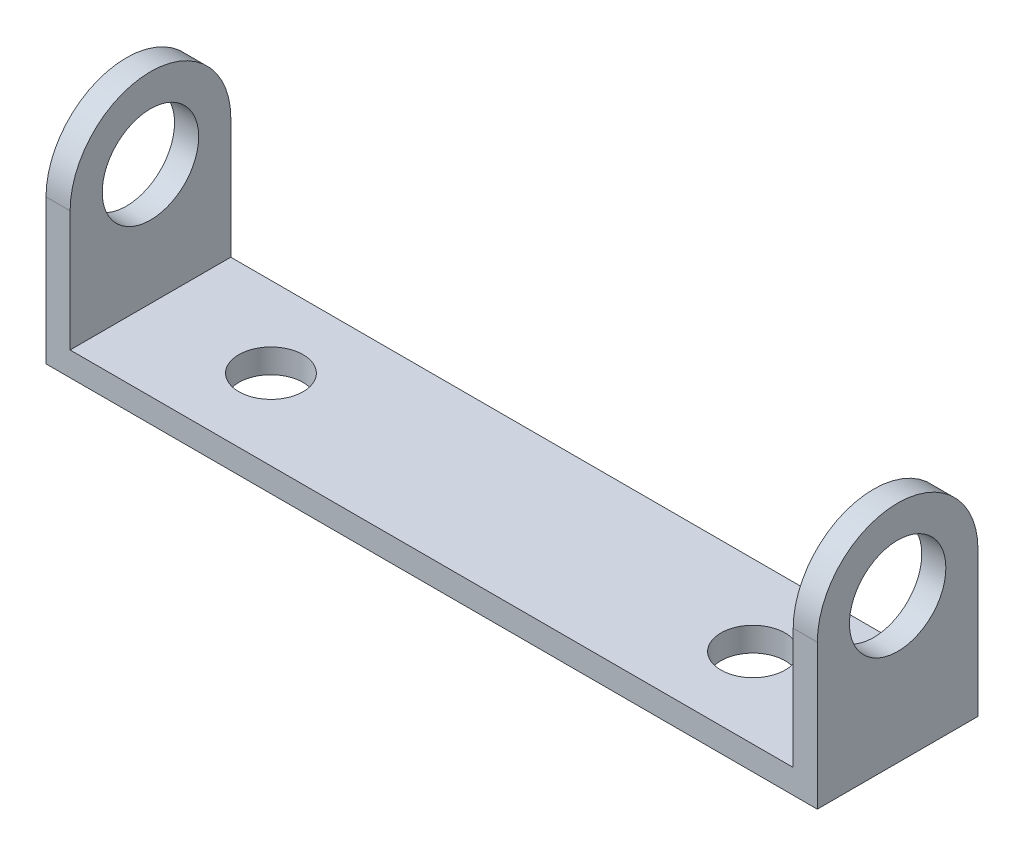
ISO-10303-21;
HEADER;
FILE_DESCRIPTION(('STEP AP214'),'2;1');
FILE_NAME('part.step','',(''),(''),'','','');
FILE_SCHEMA(('AUTOMOTIVE_DESIGN { 1 0 10303 214 1 1 1 1 }'));
ENDSEC;
DATA;
#1=APPLICATION_CONTEXT('core data for automotive mechanical design processes');
#2=APPLICATION_PROTOCOL_DEFINITION('international standard','automotive_design',2000,#1);
#3=PRODUCT_CONTEXT('',#1,'mechanical');
#4=PRODUCT('Part','Part','',(#3));
#5=PRODUCT_RELATED_PRODUCT_CATEGORY('part','',(#4));
#6=PRODUCT_DEFINITION_FORMATION('','',#4);
#7=PRODUCT_DEFINITION_CONTEXT('part definition',#1,'design');
#8=PRODUCT_DEFINITION('design','',#6,#7);
#9=PRODUCT_DEFINITION_SHAPE('','',#8);
#10=(LENGTH_UNIT() NAMED_UNIT(*) SI_UNIT(.MILLI.,.METRE.));
#11=(NAMED_UNIT(*) PLANE_ANGLE_UNIT() SI_UNIT($,.RADIAN.));
#12=(NAMED_UNIT(*) SI_UNIT($,.STERADIAN.) SOLID_ANGLE_UNIT());
#13=UNCERTAINTY_MEASURE_WITH_UNIT(LENGTH_MEASURE(1.E-05),#10,'distance_accuracy_value','');
#14=(GEOMETRIC_REPRESENTATION_CONTEXT(3) GLOBAL_UNCERTAINTY_ASSIGNED_CONTEXT((#13)) GLOBAL_UNIT_ASSIGNED_CONTEXT((#10,
#11,#12)) REPRESENTATION_CONTEXT('',''));
#15=CARTESIAN_POINT('',(0.,0.,0.));
#16=DIRECTION('',(0.,0.,1.));
#17=DIRECTION('',(1.,0.,0.));
#18=AXIS2_PLACEMENT_3D('',#15,#16,#17);
#19=CARTESIAN_POINT('',(-24.,-7.,10.));
#20=DIRECTION('',(1.,0.,0.));
#21=DIRECTION('',(0.,0.,-1.));
#22=AXIS2_PLACEMENT_3D('',#19,#20,#21);
#23=PLANE('',#22);
#24=CARTESIAN_POINT('',(-24.,2.,5.));
#25=DIRECTION('',(1.,0.,0.));
#26=DIRECTION('',(0.,0.,-1.));
#27=AXIS2_PLACEMENT_3D('',#24,#25,#26);
#28=CIRCLE('',#27,3.);
#29=CARTESIAN_POINT('',(-24.,2.,2.));
#30=VERTEX_POINT('',#29);
#31=EDGE_CURVE('E212',#30,#30,#28,.F.);
#32=ORIENTED_EDGE('',*,*,#31,.F.);
#33=EDGE_LOOP('',(#32));
#34=FACE_BOUND('',#33,.T.);
#35=CARTESIAN_POINT('',(-24.,2.,5.));
#36=DIRECTION('',(1.,0.,0.));
#37=DIRECTION('',(0.,0.,-1.));
#38=AXIS2_PLACEMENT_3D('',#35,#36,#37);
#39=CIRCLE('',#38,5.);
#40=CARTESIAN_POINT('',(-24.,2.,10.));
#41=VERTEX_POINT('',#40);
#42=CARTESIAN_POINT('',(-24.,2.,0.));
#43=VERTEX_POINT('',#42);
#44=EDGE_CURVE('E97',#41,#43,#39,.F.);
#45=ORIENTED_EDGE('',*,*,#44,.T.);
#46=DIRECTION('',(0.,-1.,0.));
#47=VECTOR('',#46,1.);
#48=CARTESIAN_POINT('',(-24.,-7.,0.));
#49=LINE('',#48,#47);
#50=CARTESIAN_POINT('',(-24.,-7.,0.));
#51=VERTEX_POINT('',#50);
#52=EDGE_CURVE('E163',#43,#51,#49,.T.);
#53=ORIENTED_EDGE('',*,*,#52,.T.);
#54=DIRECTION('',(0.,0.,-1.));
#55=VECTOR('',#54,1.);
#56=CARTESIAN_POINT('',(-24.,-7.,10.));
#57=LINE('',#56,#55);
#58=CARTESIAN_POINT('',(-24.,-7.,10.));
#59=VERTEX_POINT('',#58);
#60=EDGE_CURVE('E180',#59,#51,#57,.T.);
#61=ORIENTED_EDGE('',*,*,#60,.F.);
#62=DIRECTION('',(0.,-1.,0.));
#63=VECTOR('',#62,1.);
#64=CARTESIAN_POINT('',(-24.,-7.,10.));
#65=LINE('',#64,#63);
#66=EDGE_CURVE('E171',#41,#59,#65,.T.);
#67=ORIENTED_EDGE('',*,*,#66,.F.);
#68=EDGE_LOOP('',(#45,#53,#61,#67));
#69=FACE_BOUND('',#68,.T.);
#70=ADVANCED_FACE('F74',(#34,#69),#23,.F.);
#71=CARTESIAN_POINT('',(24.,-7.,10.));
#72=DIRECTION('',(-1.,0.,0.));
#73=DIRECTION('',(0.,0.,1.));
#74=AXIS2_PLACEMENT_3D('',#71,#72,#73);
#75=PLANE('',#74);
#76=CARTESIAN_POINT('',(24.,2.,5.));
#77=DIRECTION('',(1.,0.,0.));
#78=DIRECTION('',(0.,0.,-1.));
#79=AXIS2_PLACEMENT_3D('',#76,#77,#78);
#80=CIRCLE('',#79,3.);
#81=CARTESIAN_POINT('',(24.,2.,2.));
#82=VERTEX_POINT('',#81);
#83=EDGE_CURVE('E215',#82,#82,#80,.T.);
#84=ORIENTED_EDGE('',*,*,#83,.F.);
#85=EDGE_LOOP('',(#84));
#86=FACE_BOUND('',#85,.T.);
#87=DIRECTION('',(0.,1.,0.));
#88=VECTOR('',#87,1.);
#89=CARTESIAN_POINT('',(24.,-7.,0.));
#90=LINE('',#89,#88);
#91=CARTESIAN_POINT('',(24.,-7.,0.));
#92=VERTEX_POINT('',#91);
#93=CARTESIAN_POINT('',(24.,2.,0.));
#94=VERTEX_POINT('',#93);
#95=EDGE_CURVE('E152',#92,#94,#90,.T.);
#96=ORIENTED_EDGE('',*,*,#95,.T.);
#97=CARTESIAN_POINT('',(24.,2.,5.));
#98=DIRECTION('',(1.,0.,0.));
#99=DIRECTION('',(0.,0.,-1.));
#100=AXIS2_PLACEMENT_3D('',#97,#98,#99);
#101=CIRCLE('',#100,5.);
#102=CARTESIAN_POINT('',(24.,2.,10.));
#103=VERTEX_POINT('',#102);
#104=EDGE_CURVE('E137',#94,#103,#101,.T.);
#105=ORIENTED_EDGE('',*,*,#104,.T.);
#106=DIRECTION('',(0.,1.,0.));
#107=VECTOR('',#106,1.);
#108=CARTESIAN_POINT('',(24.,-7.,10.));
#109=LINE('',#108,#107);
#110=CARTESIAN_POINT('',(24.,-7.,10.));
#111=VERTEX_POINT('',#110);
#112=EDGE_CURVE('E202',#111,#103,#109,.T.);
#113=ORIENTED_EDGE('',*,*,#112,.F.);
#114=DIRECTION('',(0.,0.,-1.));
#115=VECTOR('',#114,1.);
#116=CARTESIAN_POINT('',(24.,-7.,10.));
#117=LINE('',#116,#115);
#118=EDGE_CURVE('E158',#111,#92,#117,.T.);
#119=ORIENTED_EDGE('',*,*,#118,.T.);
#120=EDGE_LOOP('',(#96,#105,#113,#119));
#121=FACE_BOUND('',#120,.T.);
#122=ADVANCED_FACE('F156',(#86,#121),#75,.F.);
#123=CARTESIAN_POINT('',(22.5,-5.5,10.));
#124=DIRECTION('',(1.,0.,0.));
#125=DIRECTION('',(0.,1.,0.));
#126=AXIS2_PLACEMENT_3D('',#123,#124,#125);
#127=PLANE('',#126);
#128=CARTESIAN_POINT('',(22.5,2.,5.));
#129=DIRECTION('',(1.,0.,0.));
#130=DIRECTION('',(0.,1.,0.));
#131=AXIS2_PLACEMENT_3D('',#128,#129,#130);
#132=CIRCLE('',#131,3.);
#133=CARTESIAN_POINT('',(22.5,2.,2.));
#134=VERTEX_POINT('',#133);
#135=EDGE_CURVE('E145',#134,#134,#132,.T.);
#136=ORIENTED_EDGE('',*,*,#135,.T.);
#137=EDGE_LOOP('',(#136));
#138=FACE_BOUND('',#137,.T.);
#139=CARTESIAN_POINT('',(22.5,2.,5.));
#140=DIRECTION('',(1.,0.,0.));
#141=DIRECTION('',(0.,1.,0.));
#142=AXIS2_PLACEMENT_3D('',#139,#140,#141);
#143=CIRCLE('',#142,5.);
#144=CARTESIAN_POINT('',(22.5,2.,0.));
#145=VERTEX_POINT('',#144);
#146=CARTESIAN_POINT('',(22.5,2.,10.));
#147=VERTEX_POINT('',#146);
#148=EDGE_CURVE('E89',#145,#147,#143,.T.);
#149=ORIENTED_EDGE('',*,*,#148,.F.);
#150=DIRECTION('',(0.,-1.,0.));
#151=VECTOR('',#150,1.);
#152=CARTESIAN_POINT('',(22.5,-5.5,0.));
#153=LINE('',#152,#151);
#154=CARTESIAN_POINT('',(22.5,-5.5,0.));
#155=VERTEX_POINT('',#154);
#156=EDGE_CURVE('E154',#145,#155,#153,.T.);
#157=ORIENTED_EDGE('',*,*,#156,.T.);
#158=DIRECTION('',(0.,0.,-1.));
#159=VECTOR('',#158,1.);
#160=CARTESIAN_POINT('',(22.5,-5.5,10.));
#161=LINE('',#160,#159);
#162=CARTESIAN_POINT('',(22.5,-5.5,10.));
#163=VERTEX_POINT('',#162);
#164=EDGE_CURVE('E175',#163,#155,#161,.T.);
#165=ORIENTED_EDGE('',*,*,#164,.F.);
#166=DIRECTION('',(0.,-1.,0.));
#167=VECTOR('',#166,1.);
#168=CARTESIAN_POINT('',(22.5,-5.5,10.));
#169=LINE('',#168,#167);
#170=EDGE_CURVE('E200',#147,#163,#169,.T.);
#171=ORIENTED_EDGE('',*,*,#170,.F.);
#172=EDGE_LOOP('',(#149,#157,#165,#171));
#173=FACE_BOUND('',#172,.T.);
#174=ADVANCED_FACE('F251',(#138,#173),#127,.F.);
#175=CARTESIAN_POINT('',(-22.5,7.,10.));
#176=DIRECTION('',(-1.,0.,0.));
#177=DIRECTION('',(0.,0.,1.));
#178=AXIS2_PLACEMENT_3D('',#175,#176,#177);
#179=PLANE('',#178);
#180=CARTESIAN_POINT('',(-22.5,2.,5.));
#181=DIRECTION('',(-1.,0.,0.));
#182=DIRECTION('',(0.,0.,1.));
#183=AXIS2_PLACEMENT_3D('',#180,#181,#182);
#184=CIRCLE('',#183,3.);
#185=CARTESIAN_POINT('',(-22.5,2.,2.));
#186=VERTEX_POINT('',#185);
#187=EDGE_CURVE('E77',#186,#186,#184,.T.);
#188=ORIENTED_EDGE('',*,*,#187,.T.);
#189=EDGE_LOOP('',(#188));
#190=FACE_BOUND('',#189,.T.);
#191=DIRECTION('',(0.,1.,0.));
#192=VECTOR('',#191,1.);
#193=CARTESIAN_POINT('',(-22.5,7.,0.));
#194=LINE('',#193,#192);
#195=CARTESIAN_POINT('',(-22.5,-5.5,0.));
#196=VERTEX_POINT('',#195);
#197=CARTESIAN_POINT('',(-22.5,2.,0.));
#198=VERTEX_POINT('',#197);
#199=EDGE_CURVE('E168',#196,#198,#194,.T.);
#200=ORIENTED_EDGE('',*,*,#199,.T.);
#201=CARTESIAN_POINT('',(-22.5,2.,5.));
#202=DIRECTION('',(-1.,0.,0.));
#203=DIRECTION('',(0.,0.,1.));
#204=AXIS2_PLACEMENT_3D('',#201,#202,#203);
#205=CIRCLE('',#204,5.);
#206=CARTESIAN_POINT('',(-22.5,2.,10.));
#207=VERTEX_POINT('',#206);
#208=EDGE_CURVE('E193',#207,#198,#205,.T.);
#209=ORIENTED_EDGE('',*,*,#208,.F.);
#210=DIRECTION('',(0.,1.,0.));
#211=VECTOR('',#210,1.);
#212=CARTESIAN_POINT('',(-22.5,7.,10.));
#213=LINE('',#212,#211);
#214=CARTESIAN_POINT('',(-22.5,-5.5,10.));
#215=VERTEX_POINT('',#214);
#216=EDGE_CURVE('E176',#215,#207,#213,.T.);
#217=ORIENTED_EDGE('',*,*,#216,.F.);
#218=DIRECTION('',(0.,0.,-1.));
#219=VECTOR('',#218,1.);
#220=CARTESIAN_POINT('',(-22.5,-5.5,10.));
#221=LINE('',#220,#219);
#222=EDGE_CURVE('E172',#215,#196,#221,.T.);
#223=ORIENTED_EDGE('',*,*,#222,.T.);
#224=EDGE_LOOP('',(#200,#209,#217,#223));
#225=FACE_BOUND('',#224,.T.);
#226=ADVANCED_FACE('F245',(#190,#225),#179,.F.);
#227=CARTESIAN_POINT('',(0.,0.,0.));
#228=DIRECTION('',(0.,0.,-1.));
#229=DIRECTION('',(-1.,0.,0.));
#230=AXIS2_PLACEMENT_3D('',#227,#228,#229);
#231=PLANE('',#230);
#232=ORIENTED_EDGE('',*,*,#52,.F.);
#233=DIRECTION('',(1.,0.,0.));
#234=VECTOR('',#233,1.);
#235=CARTESIAN_POINT('',(-32.4852813742386,2.,0.));
#236=LINE('',#235,#234);
#237=EDGE_CURVE('E192',#43,#198,#236,.T.);
#238=ORIENTED_EDGE('',*,*,#237,.T.);
#239=ORIENTED_EDGE('',*,*,#199,.F.);
#240=DIRECTION('',(-1.,0.,0.));
#241=VECTOR('',#240,1.);
#242=CARTESIAN_POINT('',(-22.5,-5.5,0.));
#243=LINE('',#242,#241);
#244=EDGE_CURVE('E161',#155,#196,#243,.T.);
#245=ORIENTED_EDGE('',*,*,#244,.F.);
#246=ORIENTED_EDGE('',*,*,#156,.F.);
#247=DIRECTION('',(1.,0.,0.));
#248=VECTOR('',#247,1.);
#249=CARTESIAN_POINT('',(-32.4852813742386,2.,0.));
#250=LINE('',#249,#248);
#251=EDGE_CURVE('E12',#145,#94,#250,.T.);
#252=ORIENTED_EDGE('',*,*,#251,.T.);
#253=ORIENTED_EDGE('',*,*,#95,.F.);
#254=DIRECTION('',(1.,0.,0.));
#255=VECTOR('',#254,1.);
#256=CARTESIAN_POINT('',(-24.,-7.,0.));
#257=LINE('',#256,#255);
#258=EDGE_CURVE('E159',#51,#92,#257,.T.);
#259=ORIENTED_EDGE('',*,*,#258,.F.);
#260=EDGE_LOOP('',(#232,#238,#239,#245,#246,#252,#253,#259));
#261=FACE_BOUND('',#260,.T.);
#262=ADVANCED_FACE('F150',(#261),#231,.T.);
#263=CARTESIAN_POINT('',(0.,0.,10.));
#264=DIRECTION('',(0.,0.,-1.));
#265=DIRECTION('',(-1.,0.,0.));
#266=AXIS2_PLACEMENT_3D('',#263,#264,#265);
#267=PLANE('',#266);
#268=DIRECTION('',(1.,0.,0.));
#269=VECTOR('',#268,1.);
#270=CARTESIAN_POINT('',(-32.4852813742386,2.,10.));
#271=LINE('',#270,#269);
#272=EDGE_CURVE('E144',#41,#207,#271,.T.);
#273=ORIENTED_EDGE('',*,*,#272,.F.);
#274=ORIENTED_EDGE('',*,*,#66,.T.);
#275=DIRECTION('',(1.,0.,0.));
#276=VECTOR('',#275,1.);
#277=CARTESIAN_POINT('',(-24.,-7.,10.));
#278=LINE('',#277,#276);
#279=EDGE_CURVE('E187',#59,#111,#278,.T.);
#280=ORIENTED_EDGE('',*,*,#279,.T.);
#281=ORIENTED_EDGE('',*,*,#112,.T.);
#282=DIRECTION('',(1.,0.,0.));
#283=VECTOR('',#282,1.);
#284=CARTESIAN_POINT('',(-32.4852813742386,2.,10.));
#285=LINE('',#284,#283);
#286=EDGE_CURVE('E82',#147,#103,#285,.T.);
#287=ORIENTED_EDGE('',*,*,#286,.F.);
#288=ORIENTED_EDGE('',*,*,#170,.T.);
#289=DIRECTION('',(-1.,0.,0.));
#290=VECTOR('',#289,1.);
#291=CARTESIAN_POINT('',(-22.5,-5.5,10.));
#292=LINE('',#291,#290);
#293=EDGE_CURVE('E198',#163,#215,#292,.T.);
#294=ORIENTED_EDGE('',*,*,#293,.T.);
#295=ORIENTED_EDGE('',*,*,#216,.T.);
#296=EDGE_LOOP('',(#273,#274,#280,#281,#287,#288,#294,#295));
#297=FACE_BOUND('',#296,.T.);
#298=ADVANCED_FACE('F248',(#297),#267,.F.);
#299=CARTESIAN_POINT('',(-24.,-7.,10.));
#300=DIRECTION('',(0.,1.,0.));
#301=DIRECTION('',(0.,0.,1.));
#302=AXIS2_PLACEMENT_3D('',#299,#300,#301);
#303=PLANE('',#302);
#304=CARTESIAN_POINT('',(-15.,-7.,5.));
#305=DIRECTION('',(0.,1.,0.));
#306=DIRECTION('',(0.,0.,1.));
#307=AXIS2_PLACEMENT_3D('',#304,#305,#306);
#308=CIRCLE('',#307,2.);
#309=CARTESIAN_POINT('',(-15.,-7.,7.));
#310=VERTEX_POINT('',#309);
#311=EDGE_CURVE('E218',#310,#310,#308,.T.);
#312=ORIENTED_EDGE('',*,*,#311,.T.);
#313=EDGE_LOOP('',(#312));
#314=FACE_BOUND('',#313,.T.);
#315=CARTESIAN_POINT('',(15.,-7.,5.));
#316=DIRECTION('',(0.,1.,0.));
#317=DIRECTION('',(0.,0.,1.));
#318=AXIS2_PLACEMENT_3D('',#315,#316,#317);
#319=CIRCLE('',#318,2.);
#320=CARTESIAN_POINT('',(15.,-7.,7.));
#321=VERTEX_POINT('',#320);
#322=EDGE_CURVE('E221',#321,#321,#319,.T.);
#323=ORIENTED_EDGE('',*,*,#322,.T.);
#324=EDGE_LOOP('',(#323));
#325=FACE_BOUND('',#324,.T.);
#326=ORIENTED_EDGE('',*,*,#258,.T.);
#327=ORIENTED_EDGE('',*,*,#118,.F.);
#328=ORIENTED_EDGE('',*,*,#279,.F.);
#329=ORIENTED_EDGE('',*,*,#60,.T.);
#330=EDGE_LOOP('',(#326,#327,#328,#329));
#331=FACE_BOUND('',#330,.T.);
#332=ADVANCED_FACE('F186',(#314,#325,#331),#303,.F.);
#333=CARTESIAN_POINT('',(-22.5,-5.5,10.));
#334=DIRECTION('',(0.,-1.,0.));
#335=DIRECTION('',(0.,0.,-1.));
#336=AXIS2_PLACEMENT_3D('',#333,#334,#335);
#337=PLANE('',#336);
#338=CARTESIAN_POINT('',(-15.,-5.5,5.));
#339=DIRECTION('',(0.,1.,0.));
#340=DIRECTION('',(0.,0.,1.));
#341=AXIS2_PLACEMENT_3D('',#338,#339,#340);
#342=CIRCLE('',#341,2.);
#343=CARTESIAN_POINT('',(-15.,-5.5,7.));
#344=VERTEX_POINT('',#343);
#345=EDGE_CURVE('E224',#344,#344,#342,.T.);
#346=ORIENTED_EDGE('',*,*,#345,.F.);
#347=EDGE_LOOP('',(#346));
#348=FACE_BOUND('',#347,.T.);
#349=CARTESIAN_POINT('',(15.,-5.5,5.));
#350=DIRECTION('',(0.,1.,0.));
#351=DIRECTION('',(0.,0.,1.));
#352=AXIS2_PLACEMENT_3D('',#349,#350,#351);
#353=CIRCLE('',#352,2.);
#354=CARTESIAN_POINT('',(15.,-5.5,7.));
#355=VERTEX_POINT('',#354);
#356=EDGE_CURVE('E225',#355,#355,#353,.T.);
#357=ORIENTED_EDGE('',*,*,#356,.F.);
#358=EDGE_LOOP('',(#357));
#359=FACE_BOUND('',#358,.T.);
#360=ORIENTED_EDGE('',*,*,#244,.T.);
#361=ORIENTED_EDGE('',*,*,#222,.F.);
#362=ORIENTED_EDGE('',*,*,#293,.F.);
#363=ORIENTED_EDGE('',*,*,#164,.T.);
#364=EDGE_LOOP('',(#360,#361,#362,#363));
#365=FACE_BOUND('',#364,.T.);
#366=ADVANCED_FACE('F234',(#348,#359,#365),#337,.F.);
#367=CARTESIAN_POINT('',(-32.4852813742386,2.,5.));
#368=DIRECTION('',(1.,0.,0.));
#369=DIRECTION('',(0.,0.,-1.));
#370=AXIS2_PLACEMENT_3D('',#367,#368,#369);
#371=CYLINDRICAL_SURFACE('',#370,5.);
#372=ORIENTED_EDGE('',*,*,#148,.T.);
#373=ORIENTED_EDGE('',*,*,#286,.T.);
#374=ORIENTED_EDGE('',*,*,#104,.F.);
#375=ORIENTED_EDGE('',*,*,#251,.F.);
#376=EDGE_LOOP('',(#372,#373,#374,#375));
#377=FACE_BOUND('',#376,.T.);
#378=ADVANCED_FACE('F138',(#377),#371,.T.);
#379=ORIENTED_EDGE('',*,*,#208,.T.);
#380=ORIENTED_EDGE('',*,*,#237,.F.);
#381=ORIENTED_EDGE('',*,*,#44,.F.);
#382=ORIENTED_EDGE('',*,*,#272,.T.);
#383=EDGE_LOOP('',(#379,#380,#381,#382));
#384=FACE_BOUND('',#383,.T.);
#385=ADVANCED_FACE('F268',(#384),#371,.T.);
#386=CARTESIAN_POINT('',(-32.4852813742386,2.,5.));
#387=DIRECTION('',(1.,0.,0.));
#388=DIRECTION('',(0.,0.,-1.));
#389=AXIS2_PLACEMENT_3D('',#386,#387,#388);
#390=CYLINDRICAL_SURFACE('',#389,3.);
#391=CARTESIAN_POINT('',(-24.,2.,2.));
#392=CARTESIAN_POINT('',(-23.984375,2.,2.));
#393=CARTESIAN_POINT('',(-23.96875,2.,2.));
#394=CARTESIAN_POINT('',(-23.9375,2.,2.));
#395=CARTESIAN_POINT('',(-23.921875,2.,2.));
#396=CARTESIAN_POINT('',(-23.890625,2.,2.));
#397=CARTESIAN_POINT('',(-23.875,2.,2.));
#398=CARTESIAN_POINT('',(-23.84375,2.,2.));
#399=CARTESIAN_POINT('',(-23.828125,2.,2.));
#400=CARTESIAN_POINT('',(-23.796875,2.,2.));
#401=CARTESIAN_POINT('',(-23.78125,2.,2.));
#402=CARTESIAN_POINT('',(-23.75,2.,2.));
#403=CARTESIAN_POINT('',(-23.734375,2.,2.));
#404=CARTESIAN_POINT('',(-23.703125,2.,2.));
#405=CARTESIAN_POINT('',(-23.6875,2.,2.));
#406=CARTESIAN_POINT('',(-23.65625,2.,2.));
#407=CARTESIAN_POINT('',(-23.640625,2.,2.));
#408=CARTESIAN_POINT('',(-23.609375,2.,2.));
#409=CARTESIAN_POINT('',(-23.59375,2.,2.));
#410=CARTESIAN_POINT('',(-23.5625,2.,2.));
#411=CARTESIAN_POINT('',(-23.546875,2.,2.));
#412=CARTESIAN_POINT('',(-23.515625,2.,2.));
#413=CARTESIAN_POINT('',(-23.5,2.,2.));
#414=CARTESIAN_POINT('',(-23.46875,2.,2.));
#415=CARTESIAN_POINT('',(-23.453125,2.,2.));
#416=CARTESIAN_POINT('',(-23.421875,2.,2.));
#417=CARTESIAN_POINT('',(-23.40625,2.,2.));
#418=CARTESIAN_POINT('',(-23.375,2.,2.));
#419=CARTESIAN_POINT('',(-23.359375,2.,2.));
#420=CARTESIAN_POINT('',(-23.328125,2.,2.));
#421=CARTESIAN_POINT('',(-23.3125,2.,2.));
#422=CARTESIAN_POINT('',(-23.28125,2.,2.));
#423=CARTESIAN_POINT('',(-23.265625,2.,2.));
#424=CARTESIAN_POINT('',(-23.234375,2.,2.));
#425=CARTESIAN_POINT('',(-23.21875,2.,2.));
#426=CARTESIAN_POINT('',(-23.1875,2.,2.));
#427=CARTESIAN_POINT('',(-23.171875,2.,2.));
#428=CARTESIAN_POINT('',(-23.140625,2.,2.));
#429=CARTESIAN_POINT('',(-23.125,2.,2.));
#430=CARTESIAN_POINT('',(-23.09375,2.,2.));
#431=CARTESIAN_POINT('',(-23.078125,2.,2.));
#432=CARTESIAN_POINT('',(-23.046875,2.,2.));
#433=CARTESIAN_POINT('',(-23.03125,2.,2.));
#434=CARTESIAN_POINT('',(-23.,2.,2.));
#435=CARTESIAN_POINT('',(-22.984375,2.,2.));
#436=CARTESIAN_POINT('',(-22.953125,2.,2.));
#437=CARTESIAN_POINT('',(-22.9375,2.,2.));
#438=CARTESIAN_POINT('',(-22.90625,2.,2.));
#439=CARTESIAN_POINT('',(-22.890625,2.,2.));
#440=CARTESIAN_POINT('',(-22.859375,2.,2.));
#441=CARTESIAN_POINT('',(-22.84375,2.,2.));
#442=CARTESIAN_POINT('',(-22.8125,2.,2.));
#443=CARTESIAN_POINT('',(-22.796875,2.,2.));
#444=CARTESIAN_POINT('',(-22.765625,2.,2.));
#445=CARTESIAN_POINT('',(-22.75,2.,2.));
#446=CARTESIAN_POINT('',(-22.71875,2.,2.));
#447=CARTESIAN_POINT('',(-22.703125,2.,2.));
#448=CARTESIAN_POINT('',(-22.671875,2.,2.));
#449=CARTESIAN_POINT('',(-22.65625,2.,2.));
#450=CARTESIAN_POINT('',(-22.625,2.,2.));
#451=CARTESIAN_POINT('',(-22.609375,2.,2.));
#452=CARTESIAN_POINT('',(-22.578125,2.,2.));
#453=CARTESIAN_POINT('',(-22.5625,2.,2.));
#454=CARTESIAN_POINT('',(-22.53125,2.,2.));
#455=CARTESIAN_POINT('',(-22.515625,2.,2.));
#456=CARTESIAN_POINT('',(-22.5,2.,2.));
#457=B_SPLINE_CURVE_WITH_KNOTS('',3,(#391,#392,#393,#394,#395,#396,#397,#398,#399,#400,#401,
#402,#403,#404,#405,#406,#407,#408,#409,#410,#411,#412,#413,#414,#415,#416,#417,#418,#419,#420,
#421,#422,#423,#424,#425,#426,#427,#428,#429,#430,#431,#432,#433,#434,#435,#436,#437,#438,#439,
#440,#441,#442,#443,#444,#445,#446,#447,#448,#449,#450,#451,#452,#453,#454,#455,#456),
.UNSPECIFIED.,.F.,.F.,(4,2,2,2,2,2,2,2,2,2,2,2,2,2,2,2,2,2,2,2,2,2,2,2,2,2,2,2,2,2,2,2,4),(0.,
0.0468750000000018,0.0937500000000036,0.140625000000002,0.1875,0.234375000000002,
0.281250000000004,0.328125000000002,0.375,0.421875000000002,0.468750000000004,0.515625000000006,
0.562500000000004,0.609375000000002,0.656250000000004,0.703125000000006,0.750000000000004,
0.796875000000002,0.843750000000004,0.890625000000006,0.937500000000004,0.984375000000003,
1.03125,1.07812500000001,1.12500000000001,1.171875,1.21875,1.26562500000001,1.31250000000001,
1.35937500000001,1.40625,1.45312500000001,1.50000000000001),.UNSPECIFIED.);
#458=EDGE_CURVE('BSEAM270',#30,#186,#457,.T.);
#459=ORIENTED_EDGE('',*,*,#31,.T.);
#460=ORIENTED_EDGE('',*,*,#187,.F.);
#461=ORIENTED_EDGE('',*,*,#458,.T.);
#462=ORIENTED_EDGE('',*,*,#458,.F.);
#463=EDGE_LOOP('',(#459,#461,#460,#462));
#464=FACE_BOUND('',#463,.T.);
#465=ADVANCED_FACE('F270',(#464),#390,.F.);
#466=CARTESIAN_POINT('',(24.,2.,2.));
#467=CARTESIAN_POINT('',(23.984375,2.,2.));
#468=CARTESIAN_POINT('',(23.96875,2.,2.));
#469=CARTESIAN_POINT('',(23.9375,2.,2.));
#470=CARTESIAN_POINT('',(23.921875,2.,2.));
#471=CARTESIAN_POINT('',(23.890625,2.,2.));
#472=CARTESIAN_POINT('',(23.875,2.,2.));
#473=CARTESIAN_POINT('',(23.84375,2.,2.));
#474=CARTESIAN_POINT('',(23.828125,2.,2.));
#475=CARTESIAN_POINT('',(23.796875,2.,2.));
#476=CARTESIAN_POINT('',(23.78125,2.,2.));
#477=CARTESIAN_POINT('',(23.75,2.,2.));
#478=CARTESIAN_POINT('',(23.734375,2.,2.));
#479=CARTESIAN_POINT('',(23.703125,2.,2.));
#480=CARTESIAN_POINT('',(23.6875,2.,2.));
#481=CARTESIAN_POINT('',(23.65625,2.,2.));
#482=CARTESIAN_POINT('',(23.640625,2.,2.));
#483=CARTESIAN_POINT('',(23.609375,2.,2.));
#484=CARTESIAN_POINT('',(23.59375,2.,2.));
#485=CARTESIAN_POINT('',(23.5625,2.,2.));
#486=CARTESIAN_POINT('',(23.546875,2.,2.));
#487=CARTESIAN_POINT('',(23.515625,2.,2.));
#488=CARTESIAN_POINT('',(23.5,2.,2.));
#489=CARTESIAN_POINT('',(23.46875,2.,2.));
#490=CARTESIAN_POINT('',(23.453125,2.,2.));
#491=CARTESIAN_POINT('',(23.421875,2.,2.));
#492=CARTESIAN_POINT('',(23.40625,2.,2.));
#493=CARTESIAN_POINT('',(23.375,2.,2.));
#494=CARTESIAN_POINT('',(23.359375,2.,2.));
#495=CARTESIAN_POINT('',(23.328125,2.,2.));
#496=CARTESIAN_POINT('',(23.3125,2.,2.));
#497=CARTESIAN_POINT('',(23.28125,2.,2.));
#498=CARTESIAN_POINT('',(23.265625,2.,2.));
#499=CARTESIAN_POINT('',(23.234375,2.,2.));
#500=CARTESIAN_POINT('',(23.21875,2.,2.));
#501=CARTESIAN_POINT('',(23.1875,2.,2.));
#502=CARTESIAN_POINT('',(23.171875,2.,2.));
#503=CARTESIAN_POINT('',(23.140625,2.,2.));
#504=CARTESIAN_POINT('',(23.125,2.,2.));
#505=CARTESIAN_POINT('',(23.09375,2.,2.));
#506=CARTESIAN_POINT('',(23.078125,2.,2.));
#507=CARTESIAN_POINT('',(23.046875,2.,2.));
#508=CARTESIAN_POINT('',(23.03125,2.,2.));
#509=CARTESIAN_POINT('',(23.,2.,2.));
#510=CARTESIAN_POINT('',(22.984375,2.,2.));
#511=CARTESIAN_POINT('',(22.953125,2.,2.));
#512=CARTESIAN_POINT('',(22.9375,2.,2.));
#513=CARTESIAN_POINT('',(22.90625,2.,2.));
#514=CARTESIAN_POINT('',(22.890625,2.,2.));
#515=CARTESIAN_POINT('',(22.859375,2.,2.));
#516=CARTESIAN_POINT('',(22.84375,2.,2.));
#517=CARTESIAN_POINT('',(22.8125,2.,2.));
#518=CARTESIAN_POINT('',(22.796875,2.,2.));
#519=CARTESIAN_POINT('',(22.765625,2.,2.));
#520=CARTESIAN_POINT('',(22.75,2.,2.));
#521=CARTESIAN_POINT('',(22.71875,2.,2.));
#522=CARTESIAN_POINT('',(22.703125,2.,2.));
#523=CARTESIAN_POINT('',(22.671875,2.,2.));
#524=CARTESIAN_POINT('',(22.65625,2.,2.));
#525=CARTESIAN_POINT('',(22.625,2.,2.));
#526=CARTESIAN_POINT('',(22.609375,2.,2.));
#527=CARTESIAN_POINT('',(22.578125,2.,2.));
#528=CARTESIAN_POINT('',(22.5625,2.,2.));
#529=CARTESIAN_POINT('',(22.53125,2.,2.));
#530=CARTESIAN_POINT('',(22.515625,2.,2.));
#531=CARTESIAN_POINT('',(22.5,2.,2.));
#532=B_SPLINE_CURVE_WITH_KNOTS('',3,(#466,#467,#468,#469,#470,#471,#472,#473,#474,#475,#476,
#477,#478,#479,#480,#481,#482,#483,#484,#485,#486,#487,#488,#489,#490,#491,#492,#493,#494,#495,
#496,#497,#498,#499,#500,#501,#502,#503,#504,#505,#506,#507,#508,#509,#510,#511,#512,#513,#514,
#515,#516,#517,#518,#519,#520,#521,#522,#523,#524,#525,#526,#527,#528,#529,#530,#531),
.UNSPECIFIED.,.F.,.F.,(4,2,2,2,2,2,2,2,2,2,2,2,2,2,2,2,2,2,2,2,2,2,2,2,2,2,2,2,2,2,2,2,4),(0.,
0.0468750000000018,0.0937500000000036,0.140624999999998,0.1875,0.234375000000002,
0.281249999999997,0.328124999999999,0.375,0.421875000000002,0.468750000000004,0.515624999999999,
0.5625,0.609375000000002,0.656249999999997,0.703124999999999,0.750000000000001,
0.796875000000002,0.843750000000004,0.890624999999999,0.937500000000001,0.984375000000003,
1.03125,1.078125,1.125,1.171875,1.21875,1.265625,1.3125,1.359375,1.40625,1.453125,1.5),.UNSPECIFIED.);
#533=EDGE_CURVE('BSEAM276',#82,#134,#532,.T.);
#534=ORIENTED_EDGE('',*,*,#83,.T.);
#535=ORIENTED_EDGE('',*,*,#135,.F.);
#536=ORIENTED_EDGE('',*,*,#533,.T.);
#537=ORIENTED_EDGE('',*,*,#533,.F.);
#538=EDGE_LOOP('',(#534,#536,#535,#537));
#539=FACE_BOUND('',#538,.T.);
#540=ADVANCED_FACE('F276',(#539),#390,.F.);
#541=CARTESIAN_POINT('',(15.,-15.5,5.));
#542=DIRECTION('',(0.,1.,0.));
#543=DIRECTION('',(0.,0.,1.));
#544=AXIS2_PLACEMENT_3D('',#541,#542,#543);
#545=CYLINDRICAL_SURFACE('',#544,2.);
#546=ORIENTED_EDGE('',*,*,#356,.T.);
#547=EDGE_LOOP('',(#546));
#548=FACE_BOUND('',#547,.T.);
#549=ORIENTED_EDGE('',*,*,#322,.F.);
#550=EDGE_LOOP('',(#549));
#551=FACE_BOUND('',#550,.T.);
#552=ADVANCED_FACE('F327',(#548,#551),#545,.F.);
#553=CARTESIAN_POINT('',(-15.,-15.5,5.));
#554=DIRECTION('',(0.,1.,0.));
#555=DIRECTION('',(0.,0.,1.));
#556=AXIS2_PLACEMENT_3D('',#553,#554,#555);
#557=CYLINDRICAL_SURFACE('',#556,2.);
#558=ORIENTED_EDGE('',*,*,#345,.T.);
#559=EDGE_LOOP('',(#558));
#560=FACE_BOUND('',#559,.T.);
#561=ORIENTED_EDGE('',*,*,#311,.F.);
#562=EDGE_LOOP('',(#561));
#563=FACE_BOUND('',#562,.T.);
#564=ADVANCED_FACE('F231',(#560,#563),#557,.F.);
#565=CLOSED_SHELL('',(#70,#122,#174,#226,#262,#298,#332,#366,#378,#385,#465,#540,#552,#564));
#566=MANIFOLD_SOLID_BREP('B2',#565);
#567=ADVANCED_BREP_SHAPE_REPRESENTATION('',(#18,#566),#14);
#568=SHAPE_DEFINITION_REPRESENTATION(#9,#567);
ENDSEC;
END-ISO-10303-21;
